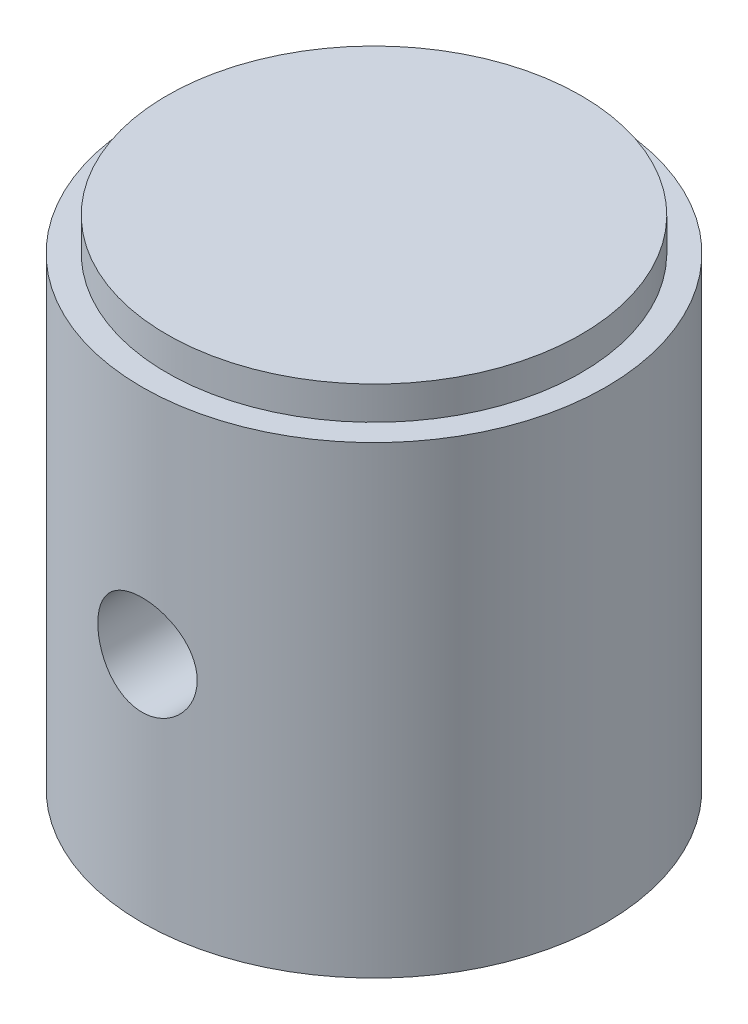
ISO-10303-21;
HEADER;
FILE_DESCRIPTION(('STEP AP214'),'2;1');
FILE_NAME('part.step','',(''),(''),'','','');
FILE_SCHEMA(('AUTOMOTIVE_DESIGN { 1 0 10303 214 1 1 1 1 }'));
ENDSEC;
DATA;
#1=APPLICATION_CONTEXT('core data for automotive mechanical design processes');
#2=APPLICATION_PROTOCOL_DEFINITION('international standard','automotive_design',2000,#1);
#3=PRODUCT_CONTEXT('',#1,'mechanical');
#4=PRODUCT('Part','Part','',(#3));
#5=PRODUCT_RELATED_PRODUCT_CATEGORY('part','',(#4));
#6=PRODUCT_DEFINITION_FORMATION('','',#4);
#7=PRODUCT_DEFINITION_CONTEXT('part definition',#1,'design');
#8=PRODUCT_DEFINITION('design','',#6,#7);
#9=PRODUCT_DEFINITION_SHAPE('','',#8);
#10=(LENGTH_UNIT() NAMED_UNIT(*) SI_UNIT(.MILLI.,.METRE.));
#11=(NAMED_UNIT(*) PLANE_ANGLE_UNIT() SI_UNIT($,.RADIAN.));
#12=(NAMED_UNIT(*) SI_UNIT($,.STERADIAN.) SOLID_ANGLE_UNIT());
#13=UNCERTAINTY_MEASURE_WITH_UNIT(LENGTH_MEASURE(1.E-05),#10,'distance_accuracy_value','');
#14=(GEOMETRIC_REPRESENTATION_CONTEXT(3) GLOBAL_UNCERTAINTY_ASSIGNED_CONTEXT((#13)) GLOBAL_UNIT_ASSIGNED_CONTEXT((#10,
#11,#12)) REPRESENTATION_CONTEXT('',''));
#15=CARTESIAN_POINT('',(0.,0.,0.));
#16=DIRECTION('',(0.,0.,1.));
#17=DIRECTION('',(1.,0.,0.));
#18=AXIS2_PLACEMENT_3D('',#15,#16,#17);
#19=CARTESIAN_POINT('',(-6.25,15.,0.));
#20=DIRECTION('',(0.,-1.,0.));
#21=DIRECTION('',(0.,0.,-1.));
#22=AXIS2_PLACEMENT_3D('',#19,#20,#21);
#23=PLANE('',#22);
#24=CARTESIAN_POINT('',(0.,15.,0.));
#25=DIRECTION('',(0.,-1.,0.));
#26=DIRECTION('',(0.,0.,-1.));
#27=AXIS2_PLACEMENT_3D('',#24,#25,#26);
#28=CIRCLE('',#27,6.25);
#29=CARTESIAN_POINT('',(0.,15.,-6.25));
#30=VERTEX_POINT('',#29);
#31=EDGE_CURVE('E11',#30,#30,#28,.T.);
#32=ORIENTED_EDGE('',*,*,#31,.F.);
#33=EDGE_LOOP('',(#32));
#34=FACE_BOUND('',#33,.T.);
#35=ADVANCED_FACE('F39',(#34),#23,.F.);
#36=CARTESIAN_POINT('',(0.,0.,0.));
#37=DIRECTION('',(0.,-1.,0.));
#38=DIRECTION('',(0.,0.,-1.));
#39=AXIS2_PLACEMENT_3D('',#36,#37,#38);
#40=CYLINDRICAL_SURFACE('',#39,6.25);
#41=CARTESIAN_POINT('',(0.,14.,0.));
#42=DIRECTION('',(0.,-1.,0.));
#43=DIRECTION('',(0.,0.,-1.));
#44=AXIS2_PLACEMENT_3D('',#41,#42,#43);
#45=CIRCLE('',#44,6.25);
#46=CARTESIAN_POINT('',(0.,14.,-6.25));
#47=VERTEX_POINT('',#46);
#48=EDGE_CURVE('E51',#47,#47,#45,.T.);
#49=ORIENTED_EDGE('',*,*,#48,.F.);
#50=EDGE_LOOP('',(#49));
#51=FACE_BOUND('',#50,.T.);
#52=ORIENTED_EDGE('',*,*,#31,.T.);
#53=EDGE_LOOP('',(#52));
#54=FACE_BOUND('',#53,.T.);
#55=ADVANCED_FACE('F117',(#51,#54),#40,.T.);
#56=CARTESIAN_POINT('',(-7.,14.,0.));
#57=DIRECTION('',(0.,-1.,0.));
#58=DIRECTION('',(0.,0.,-1.));
#59=AXIS2_PLACEMENT_3D('',#56,#57,#58);
#60=PLANE('',#59);
#61=CARTESIAN_POINT('',(0.,14.,0.));
#62=DIRECTION('',(0.,-1.,0.));
#63=DIRECTION('',(0.,0.,-1.));
#64=AXIS2_PLACEMENT_3D('',#61,#62,#63);
#65=CIRCLE('',#64,7.);
#66=CARTESIAN_POINT('',(0.,14.,-7.));
#67=VERTEX_POINT('',#66);
#68=EDGE_CURVE('E85',#67,#67,#65,.T.);
#69=ORIENTED_EDGE('',*,*,#68,.F.);
#70=EDGE_LOOP('',(#69));
#71=FACE_BOUND('',#70,.T.);
#72=ORIENTED_EDGE('',*,*,#48,.T.);
#73=EDGE_LOOP('',(#72));
#74=FACE_BOUND('',#73,.T.);
#75=ADVANCED_FACE('F113',(#71,#74),#60,.F.);
#76=CARTESIAN_POINT('',(0.,0.,0.));
#77=DIRECTION('',(0.,-1.,0.));
#78=DIRECTION('',(0.,0.,-1.));
#79=AXIS2_PLACEMENT_3D('',#76,#77,#78);
#80=CYLINDRICAL_SURFACE('',#79,7.);
#81=CARTESIAN_POINT('',(0.,8.5,-7.));
#82=CARTESIAN_POINT('',(-0.0832358860906167,8.4999971004257,-6.99999846043226));
#83=CARTESIAN_POINT('',(-0.166507195600275,8.49304839161215,-6.9985002594971));
#84=CARTESIAN_POINT('',(-0.330687344293327,8.46546434314641,-6.99266829827727));
#85=CARTESIAN_POINT('',(-0.41159440357119,8.44481895580507,-6.98833245637099));
#86=CARTESIAN_POINT('',(-0.568649323817737,8.39051563539196,-6.97730831788826));
#87=CARTESIAN_POINT('',(-0.644801963446556,8.35687102061868,-6.97062242967171));
#88=CARTESIAN_POINT('',(-0.790378177960787,8.27756591382874,-6.95562106817971));
#89=CARTESIAN_POINT('',(-0.859801981747369,8.23190583075006,-6.9473056503666));
#90=CARTESIAN_POINT('',(-0.991024790535229,8.12911970032649,-6.92981369246311));
#91=CARTESIAN_POINT('',(-1.05270503419445,8.07184377810147,-6.92062683143259));
#92=CARTESIAN_POINT('',(-1.16566042389435,7.9477736843148,-6.90250069814144));
#93=CARTESIAN_POINT('',(-1.21693467150908,7.88097869174874,-6.8935614473163));
#94=CARTESIAN_POINT('',(-1.30814204379809,7.73889424713957,-6.87684116047225));
#95=CARTESIAN_POINT('',(-1.34794958335009,7.66352248224379,-6.8690733634436));
#96=CARTESIAN_POINT('',(-1.41428823691148,7.50696554623316,-6.85572325558537));
#97=CARTESIAN_POINT('',(-1.44082087001716,7.42578104150743,-6.85014069470711));
#98=CARTESIAN_POINT('',(-1.47946574422454,7.26118891341193,-6.8418980892631));
#99=CARTESIAN_POINT('',(-1.49178779748342,7.17783272433613,-6.83919556896486));
#100=CARTESIAN_POINT('',(-1.50231395206577,7.01019576749301,-6.83689139845106));
#101=CARTESIAN_POINT('',(-1.50051971664629,6.92591510982005,-6.83728938291729));
#102=CARTESIAN_POINT('',(-1.48303326340861,6.76037531206621,-6.84110276603832));
#103=CARTESIAN_POINT('',(-1.46758398649408,6.67908911089985,-6.84446541682162));
#104=CARTESIAN_POINT('',(-1.42361054298677,6.52028975971066,-6.85374593375788));
#105=CARTESIAN_POINT('',(-1.39508566936466,6.44277681396768,-6.85966393808402));
#106=CARTESIAN_POINT('',(-1.32554551075991,6.29303712712666,-6.87344080755724));
#107=CARTESIAN_POINT('',(-1.2844361097283,6.22085548728745,-6.88131420983365));
#108=CARTESIAN_POINT('',(-1.19096007283993,6.08432483504204,-6.89810572501288));
#109=CARTESIAN_POINT('',(-1.13859196103562,6.0199768513138,-6.90702397481896));
#110=CARTESIAN_POINT('',(-1.0227954275532,5.8995406443266,-6.92512718393878));
#111=CARTESIAN_POINT('',(-0.959160233964409,5.84365129341526,-6.93431383972178));
#112=CARTESIAN_POINT('',(-0.823317306269096,5.74330626631034,-6.95175017497059));
#113=CARTESIAN_POINT('',(-0.751109428775399,5.69885078139961,-6.95999983875972));
#114=CARTESIAN_POINT('',(-0.599933462049959,5.62258932009307,-6.97465778534003));
#115=CARTESIAN_POINT('',(-0.520952258863482,5.59080858742202,-6.98106238643354));
#116=CARTESIAN_POINT('',(-0.358603146685706,5.54102435167891,-6.99128109245334));
#117=CARTESIAN_POINT('',(-0.275235851133669,5.52301892743668,-6.99509555860384));
#118=CARTESIAN_POINT('',(-0.108187670836629,5.50158378585658,-6.99965306347808));
#119=CARTESIAN_POINT('',(-0.0245431772716147,5.49788228711822,-7.00045336521066));
#120=CARTESIAN_POINT('',(0.142168973650405,5.50442457112516,-6.99905248935969));
#121=CARTESIAN_POINT('',(0.225236668127255,5.51466744796294,-6.99685150675698));
#122=CARTESIAN_POINT('',(0.387542537982806,5.5485822436617,-6.98973143045266));
#123=CARTESIAN_POINT('',(0.466811712908477,5.57211236947253,-6.98484105045459));
#124=CARTESIAN_POINT('',(0.620278450473418,5.63177694299482,-6.9728892442151));
#125=CARTESIAN_POINT('',(0.69447559258774,5.66791243431165,-6.96582763822237));
#126=CARTESIAN_POINT('',(0.836821397964754,5.75233354306033,-6.950175043904));
#127=CARTESIAN_POINT('',(0.90487257511114,5.80077979490973,-6.94156431354275));
#128=CARTESIAN_POINT('',(1.0319769255236,5.90823482488874,-6.92381033034847));
#129=CARTESIAN_POINT('',(1.091028978692,5.96724491588744,-6.91466701142097));
#130=CARTESIAN_POINT('',(1.19952711057989,6.09539737018714,-6.89668172706324));
#131=CARTESIAN_POINT('',(1.24878537255157,6.1647000992221,-6.88784792221285));
#132=CARTESIAN_POINT('',(1.3349641538604,6.31075459647799,-6.87166654559681));
#133=CARTESIAN_POINT('',(1.37188519913706,6.38750604697749,-6.86431891048055));
#134=CARTESIAN_POINT('',(1.43209741248548,6.5458722989946,-6.8520100980739));
#135=CARTESIAN_POINT('',(1.45546398641275,6.62745735643067,-6.84703574582967));
#136=CARTESIAN_POINT('',(1.48812696085335,6.79351558383364,-6.84001186708418));
#137=CARTESIAN_POINT('',(1.49742550780258,6.87798831120132,-6.83796189439706));
#138=CARTESIAN_POINT('',(1.5015999992604,7.04553234317524,-6.83704618848155));
#139=CARTESIAN_POINT('',(1.49677347258311,7.12859601498058,-6.83811476518543));
#140=CARTESIAN_POINT('',(1.47349789406331,7.29269724213259,-6.8431676318483));
#141=CARTESIAN_POINT('',(1.45504898957979,7.37373481938657,-6.84715189026714));
#142=CARTESIAN_POINT('',(1.40519345940434,7.53125865786917,-6.85755581104157));
#143=CARTESIAN_POINT('',(1.37382847170887,7.60775864866429,-6.86396764224703));
#144=CARTESIAN_POINT('',(1.29906751595601,7.75445537250685,-6.87850764590649));
#145=CARTESIAN_POINT('',(1.255670353015,7.82465147861504,-6.88663598880363));
#146=CARTESIAN_POINT('',(1.15708290349304,7.95821819372537,-6.90389055593232));
#147=CARTESIAN_POINT('',(1.10167987421237,8.02142969594698,-6.91303309938926));
#148=CARTESIAN_POINT('',(0.981086554619621,8.13775626252046,-6.93117449799694));
#149=CARTESIAN_POINT('',(0.915894009385597,8.19086899431221,-6.94017331951296));
#150=CARTESIAN_POINT('',(0.776603147268717,8.28611595950556,-6.95714491048987));
#151=CARTESIAN_POINT('',(0.702404846009641,8.32810660623098,-6.96510364570626));
#152=CARTESIAN_POINT('',(0.547850160940598,8.39895452890618,-6.97895826104019));
#153=CARTESIAN_POINT('',(0.46749910586388,8.42782302258504,-6.98485590212342));
#154=CARTESIAN_POINT('',(0.322535217553204,8.46635218513115,-6.99284848461772));
#155=CARTESIAN_POINT('',(0.258717205545979,8.47894643398003,-6.99551391888263));
#156=CARTESIAN_POINT('',(0.129939960853847,8.49577130171167,-6.99909024154719));
#157=CARTESIAN_POINT('',(0.0649807750887452,8.50000226364606,-7.00000120191314));
#158=CARTESIAN_POINT('',(0.,8.5,-7.));
#159=B_SPLINE_CURVE_WITH_KNOTS('',3,(#81,#82,#83,#84,#85,#86,#87,#88,#89,#90,#91,#92,#93,#94,
#95,#96,#97,#98,#99,#100,#101,#102,#103,#104,#105,#106,#107,#108,#109,#110,#111,#112,#113,#114,
#115,#116,#117,#118,#119,#120,#121,#122,#123,#124,#125,#126,#127,#128,#129,#130,#131,#132,#133,
#134,#135,#136,#137,#138,#139,#140,#141,#142,#143,#144,#145,#146,#147,#148,#149,#150,#151,#152,
#153,#154,#155,#156,#157,#158),.UNSPECIFIED.,.T.,.F.,(4,2,2,2,2,2,2,2,2,2,2,2,2,2,2,2,2,2,2,2,2,
2,2,2,2,2,2,2,2,2,2,2,2,2,2,2,2,2,4),(0.,0.249469836512082,0.499122883219936,0.748520824425603,
0.997910278645886,1.25074961881732,1.50361077918506,1.7591442921451,2.0146485567749,
2.26633008124666,2.51798195169165,2.76524475452928,3.01252092904568,3.26169356165968,
3.51089887920889,3.76527011050291,4.0196455970235,4.27452521139806,4.52936927256343,
4.77934665704185,5.02930780231429,5.27665060589267,5.52401389198434,5.77478733867803,
6.02559197304485,6.28082063283534,6.53603841075805,6.78982240408475,7.04356767229185,
7.29200680540294,7.5404432510827,7.78808499706785,8.03575134451623,8.28822950154114,
8.54076590397115,8.79641910357222,9.05185334010271,9.24661799132293,9.44137465337336),.UNSPECIFIED.);
#160=CARTESIAN_POINT('',(0.,8.5,-7.));
#161=VERTEX_POINT('',#160);
#162=EDGE_CURVE('E66',#161,#161,#159,.T.);
#163=ORIENTED_EDGE('',*,*,#162,.T.);
#164=EDGE_LOOP('',(#163));
#165=FACE_BOUND('',#164,.T.);
#166=CARTESIAN_POINT('',(1.5,7.,6.83739716558867));
#167=CARTESIAN_POINT('',(1.49999708238613,6.91678884751805,6.83739884558951));
#168=CARTESIAN_POINT('',(1.49305236244768,6.83354222605788,6.83893272341929));
#169=CARTESIAN_POINT('',(1.46548559252999,6.66941332775799,6.84489178429867));
#170=CARTESIAN_POINT('',(1.44485339653622,6.58853285132379,6.84931911211841));
#171=CARTESIAN_POINT('',(1.39058863684599,6.4315342504258,6.86054115293409));
#172=CARTESIAN_POINT('',(1.35697000991314,6.35541112187853,6.86733332725825));
#173=CARTESIAN_POINT('',(1.27772617673341,6.20988472605539,6.88251670848644));
#174=CARTESIAN_POINT('',(1.23210132048776,6.14048126297092,6.89090786877545));
#175=CARTESIAN_POINT('',(1.12935142570221,6.00923703851788,6.90849578796654));
#176=CARTESIAN_POINT('',(1.07206859483983,5.94752112376004,6.91770249871753));
#177=CARTESIAN_POINT('',(0.947969508129578,5.83449644559421,6.93579691710397));
#178=CARTESIAN_POINT('',(0.881152530217676,5.78318847113993,6.94468460051416));
#179=CARTESIAN_POINT('',(0.739047288464582,5.69194455550857,6.96124769109432));
#180=CARTESIAN_POINT('',(0.663680488229954,5.65212834422938,6.96890998819429));
#181=CARTESIAN_POINT('',(0.507134269342595,5.58577230855371,6.98204671042933));
#182=CARTESIAN_POINT('',(0.425955477380312,5.55923105521372,6.98752137103329));
#183=CARTESIAN_POINT('',(0.261387187671511,5.52057002906866,6.9955956528118));
#184=CARTESIAN_POINT('',(0.178049400596923,5.50823907144757,6.99823733378385));
#185=CARTESIAN_POINT('',(0.0104489453066442,5.49768872268674,7.00049362207002));
#186=CARTESIAN_POINT('',(-0.0738136201647598,5.49946777943924,7.00010856232698));
#187=CARTESIAN_POINT('',(-0.239417029250512,5.51692896466358,6.99638700862558));
#188=CARTESIAN_POINT('',(-0.320783115362113,5.53238350028992,6.99309883152431));
#189=CARTESIAN_POINT('',(-0.479739463978389,5.57639468185186,6.98399541589104));
#190=CARTESIAN_POINT('',(-0.557329560175054,5.60495190429974,6.97818006616518));
#191=CARTESIAN_POINT('',(-0.707167497556553,5.67456145888852,6.96459754646858));
#192=CARTESIAN_POINT('',(-0.779373657015789,5.71570076720435,6.95681685803946));
#193=CARTESIAN_POINT('',(-0.915940926562847,5.8092419681636,6.94015793743865));
#194=CARTESIAN_POINT('',(-0.980301006451529,5.8616453373003,6.93127956144693));
#195=CARTESIAN_POINT('',(-1.10070208800198,5.97746854452786,6.91319326460925));
#196=CARTESIAN_POINT('',(-1.15655117320251,6.04108757935704,6.90398230372853));
#197=CARTESIAN_POINT('',(-1.25682243234728,6.17688328506851,6.88643566831974));
#198=CARTESIAN_POINT('',(-1.30124432118068,6.24906016940525,6.87810001563386));
#199=CARTESIAN_POINT('',(-1.37748077573297,6.40022450106376,6.86324023586723));
#200=CARTESIAN_POINT('',(-1.40926035088923,6.47923012385244,6.85672115127775));
#201=CARTESIAN_POINT('',(-1.45903495159116,6.64163276594644,6.84630340806616));
#202=CARTESIAN_POINT('',(-1.47703206694628,6.72502911744319,6.84240435218483));
#203=CARTESIAN_POINT('',(-1.49843586024652,6.89209575264972,6.83774881255446));
#204=CARTESIAN_POINT('',(-1.5021214192864,6.97572867507731,6.83693227051701));
#205=CARTESIAN_POINT('',(-1.49555139642373,7.1424139931817,6.83837239573993));
#206=CARTESIAN_POINT('',(-1.48529673081635,7.22546642665355,6.84062886101063));
#207=CARTESIAN_POINT('',(-1.45137894635584,7.38767043498076,6.84790415484205));
#208=CARTESIAN_POINT('',(-1.42786830251553,7.46685543259696,6.85289155274364));
#209=CARTESIAN_POINT('',(-1.36827052946749,7.62016233753292,6.86503859869777));
#210=CARTESIAN_POINT('',(-1.33218223662818,7.69428377563419,6.87219844772849));
#211=CARTESIAN_POINT('',(-1.24783504416705,7.83656968475892,6.88801634080345));
#212=CARTESIAN_POINT('',(-1.19940368590792,7.90462958201219,6.89669501746317));
#213=CARTESIAN_POINT('',(-1.09197183833601,8.0317583458738,6.91451775360139));
#214=CARTESIAN_POINT('',(-1.03297009182161,8.09082614144847,6.92366186834461));
#215=CARTESIAN_POINT('',(-0.904812764420814,8.19937030294476,6.94158239990173));
#216=CARTESIAN_POINT('',(-0.83549492582877,8.24865691615701,6.95034935607746));
#217=CARTESIAN_POINT('',(-0.689401481282275,8.33488540935105,6.96635610714901));
#218=CARTESIAN_POINT('',(-0.612626216043738,8.37182785297283,6.97359597176692));
#219=CARTESIAN_POINT('',(-0.454265418982039,8.43205205463848,6.98569278381574));
#220=CARTESIAN_POINT('',(-0.372713193075171,8.45541830374628,6.99056443803698));
#221=CARTESIAN_POINT('',(-0.206725177003288,8.48809170573232,6.9974393930198));
#222=CARTESIAN_POINT('',(-0.122289789973992,8.49740081597391,6.99944309312296));
#223=CARTESIAN_POINT('',(0.04526371705283,8.50161065241186,7.00034511009056));
#224=CARTESIAN_POINT('',(0.12837450550923,8.49679515860462,6.99930459001667));
#225=CARTESIAN_POINT('',(0.292572938415962,8.47352523648097,6.99436552363383));
#226=CARTESIAN_POINT('',(0.373660616405286,8.45507103442168,6.99046702473686));
#227=CARTESIAN_POINT('',(0.531301948487271,8.40518119375051,6.98025388638537));
#228=CARTESIAN_POINT('',(0.607868365073179,8.37378431061444,6.97394646430492));
#229=CARTESIAN_POINT('',(0.754684956723222,8.29893872883088,6.9595903605066));
#230=CARTESIAN_POINT('',(0.824934544796143,8.25548891169397,6.9515415172034));
#231=CARTESIAN_POINT('',(0.958512306895246,8.15683768125733,6.93439809934493));
#232=CARTESIAN_POINT('',(1.02169036510578,8.10143584167868,6.92528708907874));
#233=CARTESIAN_POINT('',(1.13795001457643,7.98085938974965,6.90713690075836));
#234=CARTESIAN_POINT('',(1.19102918062422,7.91568243664439,6.89809774045682));
#235=CARTESIAN_POINT('',(1.28623261596675,7.77640950681432,6.88098693651915));
#236=CARTESIAN_POINT('',(1.32820897809616,7.70221064171297,6.87292905956533));
#237=CARTESIAN_POINT('',(1.39903004659825,7.54765627907675,6.85886497228049));
#238=CARTESIAN_POINT('',(1.42788606423931,7.46730615474693,6.85285699581573));
#239=CARTESIAN_POINT('',(1.46638607121558,7.32237386881414,6.84470560641996));
#240=CARTESIAN_POINT('',(1.47896752507743,7.25858832429217,6.84198283087953));
#241=CARTESIAN_POINT('',(1.49577544043437,7.12987568842268,6.83832799504406));
#242=CARTESIAN_POINT('',(1.50000227727981,7.06494864849168,6.83739585430069));
#243=CARTESIAN_POINT('',(1.5,7.,6.83739716558867));
#244=B_SPLINE_CURVE_WITH_KNOTS('',3,(#166,#167,#168,#169,#170,#171,#172,#173,#174,#175,#176,
#177,#178,#179,#180,#181,#182,#183,#184,#185,#186,#187,#188,#189,#190,#191,#192,#193,#194,#195,
#196,#197,#198,#199,#200,#201,#202,#203,#204,#205,#206,#207,#208,#209,#210,#211,#212,#213,#214,
#215,#216,#217,#218,#219,#220,#221,#222,#223,#224,#225,#226,#227,#228,#229,#230,#231,#232,#233,
#234,#235,#236,#237,#238,#239,#240,#241,#242,#243),.UNSPECIFIED.,.T.,.F.,(4,2,2,2,2,2,2,2,2,2,2,
2,2,2,2,2,2,2,2,2,2,2,2,2,2,2,2,2,2,2,2,2,2,2,2,2,2,2,4),(0.,0.249395482027528,
0.498976038479964,0.748289491152759,0.997595676735283,1.25053229582692,1.50348808112879,
1.75899134820278,2.01446710646267,2.26609508151929,2.51769537777241,2.76518557667372,
3.01268666607584,3.26193888143437,3.51122378872315,3.76548960779295,4.01976177023092,
4.27473287411781,4.52966530953839,4.77960433192523,5.02952692653917,5.27663180749375,
5.5237595556315,5.77455010216318,6.02537049659078,6.2806621468321,6.53594213875542,
6.78961589824375,7.04325433208539,7.29183199644127,7.540405537151,7.78824009619483,
8.03609766151366,8.28848914160965,8.54094115631233,8.79660380167249,9.05204561611688,
9.24671456122272,9.44137476018023),.UNSPECIFIED.);
#245=CARTESIAN_POINT('',(1.5,7.,6.83739716558867));
#246=VERTEX_POINT('',#245);
#247=EDGE_CURVE('E72',#246,#246,#244,.T.);
#248=ORIENTED_EDGE('',*,*,#247,.T.);
#249=EDGE_LOOP('',(#248));
#250=FACE_BOUND('',#249,.T.);
#251=CARTESIAN_POINT('',(0.,0.,0.));
#252=DIRECTION('',(0.,-1.,0.));
#253=DIRECTION('',(0.,0.,-1.));
#254=AXIS2_PLACEMENT_3D('',#251,#252,#253);
#255=CIRCLE('',#254,7.);
#256=CARTESIAN_POINT('',(0.,0.,-7.));
#257=VERTEX_POINT('',#256);
#258=EDGE_CURVE('E82',#257,#257,#255,.T.);
#259=ORIENTED_EDGE('',*,*,#258,.F.);
#260=EDGE_LOOP('',(#259));
#261=FACE_BOUND('',#260,.T.);
#262=ORIENTED_EDGE('',*,*,#68,.T.);
#263=EDGE_LOOP('',(#262));
#264=FACE_BOUND('',#263,.T.);
#265=ADVANCED_FACE('F107',(#165,#250,#261,#264),#80,.T.);
#266=CARTESIAN_POINT('',(-7.,0.,0.));
#267=DIRECTION('',(0.,1.,0.));
#268=DIRECTION('',(0.,0.,1.));
#269=AXIS2_PLACEMENT_3D('',#266,#267,#268);
#270=PLANE('',#269);
#271=CARTESIAN_POINT('',(0.,0.,0.));
#272=DIRECTION('',(0.,-1.,0.));
#273=DIRECTION('',(0.,0.,-1.));
#274=AXIS2_PLACEMENT_3D('',#271,#272,#273);
#275=CIRCLE('',#274,6.2);
#276=CARTESIAN_POINT('',(0.,0.,-6.2));
#277=VERTEX_POINT('',#276);
#278=EDGE_CURVE('E69',#277,#277,#275,.T.);
#279=ORIENTED_EDGE('',*,*,#278,.F.);
#280=EDGE_LOOP('',(#279));
#281=FACE_BOUND('',#280,.T.);
#282=ORIENTED_EDGE('',*,*,#258,.T.);
#283=EDGE_LOOP('',(#282));
#284=FACE_BOUND('',#283,.T.);
#285=ADVANCED_FACE('F112',(#281,#284),#270,.F.);
#286=CARTESIAN_POINT('',(0.,0.,0.));
#287=DIRECTION('',(0.,-1.,0.));
#288=DIRECTION('',(0.,0.,-1.));
#289=AXIS2_PLACEMENT_3D('',#286,#287,#288);
#290=CONICAL_SURFACE('',#289,6.2,0.349065850398867);
#291=CARTESIAN_POINT('',(0.,3.98384225820919,0.));
#292=DIRECTION('',(0.,-1.,0.));
#293=DIRECTION('',(0.,0.,-1.));
#294=AXIS2_PLACEMENT_3D('',#291,#292,#293);
#295=CIRCLE('',#294,4.75);
#296=CARTESIAN_POINT('',(0.,3.98384225820919,-4.75));
#297=VERTEX_POINT('',#296);
#298=EDGE_CURVE('E65',#297,#297,#295,.T.);
#299=ORIENTED_EDGE('',*,*,#298,.F.);
#300=EDGE_LOOP('',(#299));
#301=FACE_BOUND('',#300,.T.);
#302=ORIENTED_EDGE('',*,*,#278,.T.);
#303=EDGE_LOOP('',(#302));
#304=FACE_BOUND('',#303,.T.);
#305=ADVANCED_FACE('F149',(#301,#304),#290,.F.);
#306=CARTESIAN_POINT('',(0.,0.,0.));
#307=DIRECTION('',(0.,-1.,0.));
#308=DIRECTION('',(0.,0.,-1.));
#309=AXIS2_PLACEMENT_3D('',#306,#307,#308);
#310=CYLINDRICAL_SURFACE('',#309,4.75);
#311=CARTESIAN_POINT('',(0.,8.5,-4.75));
#312=CARTESIAN_POINT('',(0.0820835447314042,8.4999995960029,-4.74999967904615));
#313=CARTESIAN_POINT('',(0.164171496501827,8.49324013050539,-4.74785228936724));
#314=CARTESIAN_POINT('',(0.325944116631497,8.46645355077682,-4.73949648091444));
#315=CARTESIAN_POINT('',(0.405628283459122,8.44642368752273,-4.73328722070904));
#316=CARTESIAN_POINT('',(0.560237269504344,8.39384104381599,-4.71748543187023));
#317=CARTESIAN_POINT('',(0.635169334090949,8.36130788889304,-4.7078982073406));
#318=CARTESIAN_POINT('',(0.778514579207214,8.28472646357131,-4.68632862599565));
#319=CARTESIAN_POINT('',(0.846926688392994,8.24067630516156,-4.67434587655187));
#320=CARTESIAN_POINT('',(0.977443078754498,8.14085266257358,-4.64883376662147));
#321=CARTESIAN_POINT('',(1.03931346588882,8.08478215126322,-4.63527018347255));
#322=CARTESIAN_POINT('',(1.15294742613925,7.96314171987723,-4.60832176901776));
#323=CARTESIAN_POINT('',(1.2047090669501,7.89756998779059,-4.5949369723419));
#324=CARTESIAN_POINT('',(1.29793466853577,7.75675121788412,-4.56949296853185));
#325=CARTESIAN_POINT('',(1.33910462019172,7.68130119655586,-4.55747591989588));
#326=CARTESIAN_POINT('',(1.40807389327236,7.52410753822376,-4.53664362085522));
#327=CARTESIAN_POINT('',(1.4358768216778,7.44236560595466,-4.52782750686213));
#328=CARTESIAN_POINT('',(1.47646364106285,7.27755109763056,-4.51475360613692));
#329=CARTESIAN_POINT('',(1.48968210274354,7.1945962655912,-4.51036428133252));
#330=CARTESIAN_POINT('',(1.50208257395981,7.02753910178015,-4.50625061102435));
#331=CARTESIAN_POINT('',(1.50126840605207,6.94343708874345,-4.50652499510326));
#332=CARTESIAN_POINT('',(1.48596623804715,6.7800844811611,-4.51159176137022));
#333=CARTESIAN_POINT('',(1.47203288124122,6.70077528375917,-4.51620087396631));
#334=CARTESIAN_POINT('',(1.43178798005592,6.5456834725574,-4.52911970742075));
#335=CARTESIAN_POINT('',(1.40547509472982,6.46990124177497,-4.53742982916608));
#336=CARTESIAN_POINT('',(1.34083084084602,6.32270273212435,-4.55695325959034));
#337=CARTESIAN_POINT('',(1.30232683858134,6.25136797684519,-4.56820783899944));
#338=CARTESIAN_POINT('',(1.21451321691615,6.11599117565043,-4.59233341866295));
#339=CARTESIAN_POINT('',(1.16520074091948,6.05195106446551,-4.60520484585311));
#340=CARTESIAN_POINT('',(1.05445721763047,5.9298486385015,-4.63184688202887));
#341=CARTESIAN_POINT('',(0.992568961591257,5.87220327092588,-4.64563145900086));
#342=CARTESIAN_POINT('',(0.859832533931193,5.7680067597299,-4.67201892608795));
#343=CARTESIAN_POINT('',(0.78898367078958,5.72145647315559,-4.68462172487032));
#344=CARTESIAN_POINT('',(0.639521244304239,5.64048095552522,-4.70736283385872));
#345=CARTESIAN_POINT('',(0.56084940322956,5.6061570539756,-4.71748034190943));
#346=CARTESIAN_POINT('',(0.398454273025006,5.55135522219803,-4.73396063106369));
#347=CARTESIAN_POINT('',(0.314732560358459,5.53087299501027,-4.74032457733139));
#348=CARTESIAN_POINT('',(0.148151942001064,5.50505054086085,-4.74839235389519));
#349=CARTESIAN_POINT('',(0.0653887879529921,5.49914603419765,-4.75026975398177));
#350=CARTESIAN_POINT('',(-0.0999556894804184,5.50105311741636,-4.74966735792893));
#351=CARTESIAN_POINT('',(-0.18253703820438,5.50886265646202,-4.74718821327919));
#352=CARTESIAN_POINT('',(-0.342984606452104,5.53752408988407,-4.73826543461407));
#353=CARTESIAN_POINT('',(-0.420917353280693,5.55803859127942,-4.73192442641255));
#354=CARTESIAN_POINT('',(-0.57221157175127,5.61111437313638,-4.71602217273613));
#355=CARTESIAN_POINT('',(-0.645572474036245,5.64367715054722,-4.70646052712339));
#356=CARTESIAN_POINT('',(-0.787656381223483,5.7208230900637,-4.68480447515659));
#357=CARTESIAN_POINT('',(-0.856220098995368,5.76568325707307,-4.67265334948307));
#358=CARTESIAN_POINT('',(-0.985034898254589,5.86581932112607,-4.64720609363859));
#359=CARTESIAN_POINT('',(-1.04528367215737,5.92109809954076,-4.63390964727142));
#360=CARTESIAN_POINT('',(-1.15829337789972,6.04315659674265,-4.60699149316922));
#361=CARTESIAN_POINT('',(-1.21065200367446,6.11031156057145,-4.593378435549));
#362=CARTESIAN_POINT('',(-1.3033950666371,6.25275003854341,-4.5679297313532));
#363=CARTESIAN_POINT('',(-1.34377965554056,6.32803344967959,-4.55609406225838));
#364=CARTESIAN_POINT('',(-1.41118548758715,6.48446194888063,-4.53566962908159));
#365=CARTESIAN_POINT('',(-1.43825519702983,6.56558452692425,-4.52706911631109));
#366=CARTESIAN_POINT('',(-1.47824972090378,6.73156480012263,-4.5141696846939));
#367=CARTESIAN_POINT('',(-1.49118006577835,6.81642102138811,-4.50986908404445));
#368=CARTESIAN_POINT('',(-1.50212620605735,6.9832469259302,-4.50623416787646));
#369=CARTESIAN_POINT('',(-1.50080314084641,7.06516895999845,-4.50667969384457));
#370=CARTESIAN_POINT('',(-1.48488083195079,7.22756165788626,-4.51195053556042));
#371=CARTESIAN_POINT('',(-1.47028223238921,7.30803239192909,-4.51677563881295));
#372=CARTESIAN_POINT('',(-1.42866989928935,7.46402847078252,-4.53010652438159));
#373=CARTESIAN_POINT('',(-1.40184917312304,7.53961057278835,-4.53855497041869));
#374=CARTESIAN_POINT('',(-1.33670650315647,7.6852619957888,-4.55816492249634));
#375=CARTESIAN_POINT('',(-1.29838218467217,7.75533017477246,-4.56932698861838));
#376=CARTESIAN_POINT('',(-1.2095354013046,7.89098674529753,-4.5936611779216));
#377=CARTESIAN_POINT('',(-1.15858784628932,7.95628550826839,-4.60689565835744));
#378=CARTESIAN_POINT('',(-1.0466842406539,8.07762083763069,-4.63360081206469));
#379=CARTESIAN_POINT('',(-0.985725490335815,8.13365489742713,-4.64707154816902));
#380=CARTESIAN_POINT('',(-0.853066326423951,8.23675692430509,-4.67327443028954));
#381=CARTESIAN_POINT('',(-0.781073823515226,8.28346039072967,-4.68596655437371));
#382=CARTESIAN_POINT('',(-0.629859472842861,8.36404168437099,-4.70867379243004));
#383=CARTESIAN_POINT('',(-0.550640331972045,8.39792428963458,-4.71868990328235));
#384=CARTESIAN_POINT('',(-0.393635914977817,8.44959876910323,-4.7342664308075));
#385=CARTESIAN_POINT('',(-0.316225133186439,8.46844387958559,-4.74011460510933));
#386=CARTESIAN_POINT('',(-0.159210635950567,8.49364336266444,-4.7479811380776));
#387=CARTESIAN_POINT('',(-0.0796073905560852,8.50000039181002,-4.75000031127187));
#388=CARTESIAN_POINT('',(0.,8.5,-4.75));
#389=B_SPLINE_CURVE_WITH_KNOTS('',3,(#311,#312,#313,#314,#315,#316,#317,#318,#319,#320,#321,
#322,#323,#324,#325,#326,#327,#328,#329,#330,#331,#332,#333,#334,#335,#336,#337,#338,#339,#340,
#341,#342,#343,#344,#345,#346,#347,#348,#349,#350,#351,#352,#353,#354,#355,#356,#357,#358,#359,
#360,#361,#362,#363,#364,#365,#366,#367,#368,#369,#370,#371,#372,#373,#374,#375,#376,#377,#378,
#379,#380,#381,#382,#383,#384,#385,#386,#387,#388),.UNSPECIFIED.,.T.,.F.,(4,2,2,2,2,2,2,2,2,2,2,
2,2,2,2,2,2,2,2,2,2,2,2,2,2,2,2,2,2,2,2,2,2,2,2,2,2,2,4),(0.,0.24595797085269,0.49196690895122,
0.737591271008994,0.983255924152798,1.23588716608584,1.4885666517754,1.74764569043262,
2.00665477945945,2.25771831624514,2.50871346318116,2.74955211816805,2.99041686673246,
3.23485763830864,3.47936309176113,3.73524847406481,3.99115361598384,4.24913282924922,
4.50703191953741,4.75477968540458,5.00249040554177,5.24388939060298,5.48531837858214,
5.73270991189647,5.98016996447342,6.23765665880274,6.49514009053907,6.75167921313646,
7.00811795759371,7.25271509638717,7.49730036806766,7.73815036093371,7.97905010664366,
8.22954585775128,8.48010927077556,8.73909121554315,8.99797654827696,9.23656564494835,
9.47510398183575),.UNSPECIFIED.);
#390=CARTESIAN_POINT('',(0.,8.5,-4.75));
#391=VERTEX_POINT('',#390);
#392=EDGE_CURVE('E42',#391,#391,#389,.T.);
#393=ORIENTED_EDGE('',*,*,#392,.T.);
#394=EDGE_LOOP('',(#393));
#395=FACE_BOUND('',#394,.T.);
#396=CARTESIAN_POINT('',(1.5,7.,4.50693909432999));
#397=CARTESIAN_POINT('',(1.49999958004515,7.08196828267614,4.50693949515469));
#398=CARTESIAN_POINT('',(1.49325840231682,7.16394098372474,4.50919970874085));
#399=CARTESIAN_POINT('',(1.46655104887094,7.32547500949945,4.5179553253781));
#400=CARTESIAN_POINT('',(1.44658152131253,7.40503571772268,4.52445180182028));
#401=CARTESIAN_POINT('',(1.39417508352591,7.55938220284953,4.54087234787262));
#402=CARTESIAN_POINT('',(1.36176059537411,7.63417628681151,4.55079024986066));
#403=CARTESIAN_POINT('',(1.28545946652237,7.77728605600465,4.57292751994247));
#404=CARTESIAN_POINT('',(1.24157071835092,7.84560054798797,4.58514731070763));
#405=CARTESIAN_POINT('',(1.14191784971278,7.97620867145206,4.6109923380212));
#406=CARTESIAN_POINT('',(1.08582030493755,8.03824156373591,4.62464992232587));
#407=CARTESIAN_POINT('',(0.964055421977067,8.15219435282351,4.65155671093151));
#408=CARTESIAN_POINT('',(0.898386720233771,8.20411280620364,4.66480585671778));
#409=CARTESIAN_POINT('',(0.757464836701735,8.29751850612538,4.68977365915903));
#410=CARTESIAN_POINT('',(0.682025001056138,8.33873651170335,4.70144979545653));
#411=CARTESIAN_POINT('',(0.524852067423557,8.40779725722458,4.72157773016224));
#412=CARTESIAN_POINT('',(0.443120487221092,8.43564321130615,4.73003030329318));
#413=CARTESIAN_POINT('',(0.278414775826808,8.47629673110112,4.74252974850081));
#414=CARTESIAN_POINT('',(0.195560751143445,8.48955010145606,4.74670693307633));
#415=CARTESIAN_POINT('',(0.0287067286102972,8.50205550409757,4.75064554540298));
#416=CARTESIAN_POINT('',(-0.0552929988694201,8.50131078451008,4.75040799755164));
#417=CARTESIAN_POINT('',(-0.218913619351864,8.48613280044412,4.74563427350171));
#418=CARTESIAN_POINT('',(-0.298584494979865,8.47218295028315,4.74124990899214));
#419=CARTESIAN_POINT('',(-0.454390311754809,8.43178484234958,4.72886249486103));
#420=CARTESIAN_POINT('',(-0.530525020335841,8.40533576380501,4.72085920760149));
#421=CARTESIAN_POINT('',(-0.678203652675078,8.34038381811517,4.7019310355991));
#422=CARTESIAN_POINT('',(-0.74967901329581,8.30173567232402,4.69097118266663));
#423=CARTESIAN_POINT('',(-0.885279102378908,8.21359968541286,4.66728249867119));
#424=CARTESIAN_POINT('',(-0.949401935733847,8.16410905917775,4.65455321340063));
#425=CARTESIAN_POINT('',(-1.07135837440922,8.05321803376508,4.62803989727125));
#426=CARTESIAN_POINT('',(-1.12880871974839,7.99140076594742,4.61423403233704));
#427=CARTESIAN_POINT('',(-1.23264301054731,7.85888184102085,4.58758892442481));
#428=CARTESIAN_POINT('',(-1.2790255944206,7.7881790924274,4.57474980051078));
#429=CARTESIAN_POINT('',(-1.35986638692084,7.63879322816875,4.55138024059369));
#430=CARTESIAN_POINT('',(-1.39417963639867,7.5600268613839,4.54087839223385));
#431=CARTESIAN_POINT('',(-1.44893342452635,7.39742189828439,4.5237069894911));
#432=CARTESIAN_POINT('',(-1.46937907304313,7.31358518268336,4.5170360236621));
#433=CARTESIAN_POINT('',(-1.49507161979024,7.14689763967609,4.5085959379324));
#434=CARTESIAN_POINT('',(-1.50090655288536,7.06414699632123,4.50663729609299));
#435=CARTESIAN_POINT('',(-1.49886513965521,6.89884228403352,4.50731687465408));
#436=CARTESIAN_POINT('',(-1.49099096720734,6.81628818601273,4.50995436623754));
#437=CARTESIAN_POINT('',(-1.46228084598242,6.65627331210253,4.51934163323602));
#438=CARTESIAN_POINT('',(-1.4418371919129,6.57873407933305,4.5259668251803));
#439=CARTESIAN_POINT('',(-1.38903056686353,6.42819606752119,4.54245022183902));
#440=CARTESIAN_POINT('',(-1.35666562487664,6.35519804163378,4.55230896114271));
#441=CARTESIAN_POINT('',(-1.2798587413425,6.21345829627849,4.57450539166734));
#442=CARTESIAN_POINT('',(-1.2350921421442,6.14490277172614,4.58690698850857));
#443=CARTESIAN_POINT('',(-1.13512998682984,6.01606295424143,4.61266077618539));
#444=CARTESIAN_POINT('',(-1.07993166463933,5.9557808624266,4.62601321856053));
#445=CARTESIAN_POINT('',(-0.957886037531119,5.84255822339201,4.65285013455169));
#446=CARTESIAN_POINT('',(-0.890643665109767,5.79003801711159,4.66631614662306));
#447=CARTESIAN_POINT('',(-0.747973360630616,5.69700869180867,4.6912975579683));
#448=CARTESIAN_POINT('',(-0.672545793179844,5.65649903807951,4.70281304406929));
#449=CARTESIAN_POINT('',(-0.516099288450847,5.58902763746837,4.72253168708172));
#450=CARTESIAN_POINT('',(-0.435125281433143,5.56196896821548,4.73075845435933));
#451=CARTESIAN_POINT('',(-0.269469399491868,5.521946955657,4.7430763734001));
#452=CARTESIAN_POINT('',(-0.184788721002362,5.50897909853475,4.74716884950256));
#453=CARTESIAN_POINT('',(-0.0179886485878245,5.49787969673414,4.7506674317259));
#454=CARTESIAN_POINT('',(0.0640868361538644,5.49914159728498,4.75026513795577));
#455=CARTESIAN_POINT('',(0.226803220963032,5.51499454533605,4.74528029002946));
#456=CARTESIAN_POINT('',(0.307444217580877,5.52958469227172,4.74069801830655));
#457=CARTESIAN_POINT('',(0.463969836764499,5.57129105994288,4.72793024704182));
#458=CARTESIAN_POINT('',(0.539902672774311,5.5982419327476,4.71979237633648));
#459=CARTESIAN_POINT('',(0.686204345183072,5.66375485659461,4.70075227796057));
#460=CARTESIAN_POINT('',(0.756572215112847,5.70231891893586,4.68984957149724));
#461=CARTESIAN_POINT('',(0.892382156713933,5.79149731947347,4.66594837362514));
#462=CARTESIAN_POINT('',(0.957571386267192,5.84248067140566,4.65289067194133));
#463=CARTESIAN_POINT('',(1.07867009763973,5.95440321249846,4.62631837968684));
#464=CARTESIAN_POINT('',(1.13457676425287,6.01534541088941,4.61280365200012));
#465=CARTESIAN_POINT('',(1.23744612372159,6.14794144277214,4.58630016066439));
#466=CARTESIAN_POINT('',(1.28403955823579,6.21988929825807,4.5733449634976));
#467=CARTESIAN_POINT('',(1.36442560849337,6.37098605672067,4.55001145096037));
#468=CARTESIAN_POINT('',(1.39822313048984,6.45013218524502,4.53963214845841));
#469=CARTESIAN_POINT('',(1.44974900503547,6.60694645257124,4.52342799882926));
#470=CARTESIAN_POINT('',(1.46853682069789,6.6842364458579,4.51730787458817));
#471=CARTESIAN_POINT('',(1.4936609032698,6.84101662585257,4.50906374742014));
#472=CARTESIAN_POINT('',(1.50000040727695,6.92050623511172,4.50693870560567));
#473=CARTESIAN_POINT('',(1.5,7.,4.50693909432999));
#474=B_SPLINE_CURVE_WITH_KNOTS('',3,(#396,#397,#398,#399,#400,#401,#402,#403,#404,#405,#406,
#407,#408,#409,#410,#411,#412,#413,#414,#415,#416,#417,#418,#419,#420,#421,#422,#423,#424,#425,
#426,#427,#428,#429,#430,#431,#432,#433,#434,#435,#436,#437,#438,#439,#440,#441,#442,#443,#444,
#445,#446,#447,#448,#449,#450,#451,#452,#453,#454,#455,#456,#457,#458,#459,#460,#461,#462,#463,
#464,#465,#466,#467,#468,#469,#470,#471,#472,#473),.UNSPECIFIED.,.T.,.F.,(4,2,2,2,2,2,2,2,2,2,2,
2,2,2,2,2,2,2,2,2,2,2,2,2,2,2,2,2,2,2,2,2,2,2,2,2,2,2,4),(0.,0.245611090579273,
0.491284438685785,0.736517218845767,0.981795072467574,1.23487733964253,1.48799569757339,
1.74697244897189,2.00588692090239,2.25665093580603,2.50735676398231,2.74922580012767,
2.99111072100683,3.2359924360223,3.48093712787276,3.7362950135404,3.99168429786021,
4.25004385973256,4.50830817072249,4.75599786818586,5.00364829262799,5.24393641423545,
5.48426428174336,5.73160040316639,5.97900220045884,6.23690747266809,6.49480126127746,
6.75080881416402,7.0067343340116,7.25179355317672,7.49683621537552,7.73869250201122,
7.9805907000726,8.2308132702795,8.48111158966217,8.739930558781,8.99865018989115,
9.23690856092584,9.47510496630383),.UNSPECIFIED.);
#475=CARTESIAN_POINT('',(1.5,7.,4.50693909432999));
#476=VERTEX_POINT('',#475);
#477=EDGE_CURVE('E89',#476,#476,#474,.T.);
#478=ORIENTED_EDGE('',*,*,#477,.T.);
#479=EDGE_LOOP('',(#478));
#480=FACE_BOUND('',#479,.T.);
#481=CARTESIAN_POINT('',(0.,11.,0.));
#482=DIRECTION('',(0.,-1.,0.));
#483=DIRECTION('',(0.,0.,-1.));
#484=AXIS2_PLACEMENT_3D('',#481,#482,#483);
#485=CIRCLE('',#484,4.75);
#486=CARTESIAN_POINT('',(0.,11.,-4.75));
#487=VERTEX_POINT('',#486);
#488=EDGE_CURVE('E63',#487,#487,#485,.T.);
#489=ORIENTED_EDGE('',*,*,#488,.F.);
#490=EDGE_LOOP('',(#489));
#491=FACE_BOUND('',#490,.T.);
#492=ORIENTED_EDGE('',*,*,#298,.T.);
#493=EDGE_LOOP('',(#492));
#494=FACE_BOUND('',#493,.T.);
#495=ADVANCED_FACE('F59',(#395,#480,#491,#494),#310,.F.);
#496=CARTESIAN_POINT('',(0.,11.,0.));
#497=DIRECTION('',(0.,-1.,0.));
#498=DIRECTION('',(0.,0.,-1.));
#499=AXIS2_PLACEMENT_3D('',#496,#497,#498);
#500=CONICAL_SURFACE('',#499,4.75,1.02974425867666);
#501=CARTESIAN_POINT('',(0.,13.8540879403809,0.));
#502=VERTEX_POINT('',#501);
#503=VERTEX_LOOP('',#502);
#504=FACE_BOUND('',#503,.T.);
#505=ORIENTED_EDGE('',*,*,#488,.T.);
#506=EDGE_LOOP('',(#505));
#507=FACE_BOUND('',#506,.T.);
#508=ADVANCED_FACE('F55',(#504,#507),#500,.F.);
#509=CARTESIAN_POINT('',(0.,7.,-7.));
#510=DIRECTION('',(0.,0.,1.));
#511=DIRECTION('',(1.,0.,0.));
#512=AXIS2_PLACEMENT_3D('',#509,#510,#511);
#513=CYLINDRICAL_SURFACE('',#512,1.5);
#514=ORIENTED_EDGE('',*,*,#477,.F.);
#515=EDGE_LOOP('',(#514));
#516=FACE_BOUND('',#515,.T.);
#517=ORIENTED_EDGE('',*,*,#247,.F.);
#518=EDGE_LOOP('',(#517));
#519=FACE_BOUND('',#518,.T.);
#520=ADVANCED_FACE('F58',(#516,#519),#513,.F.);
#521=ORIENTED_EDGE('',*,*,#392,.F.);
#522=EDGE_LOOP('',(#521));
#523=FACE_BOUND('',#522,.T.);
#524=ORIENTED_EDGE('',*,*,#162,.F.);
#525=EDGE_LOOP('',(#524));
#526=FACE_BOUND('',#525,.T.);
#527=ADVANCED_FACE('F96',(#523,#526),#513,.F.);
#528=CLOSED_SHELL('',(#35,#55,#75,#265,#285,#305,#495,#508,#520,#527));
#529=MANIFOLD_SOLID_BREP('B2',#528);
#530=ADVANCED_BREP_SHAPE_REPRESENTATION('',(#18,#529),#14);
#531=SHAPE_DEFINITION_REPRESENTATION(#9,#530);
ENDSEC;
END-ISO-10303-21;
